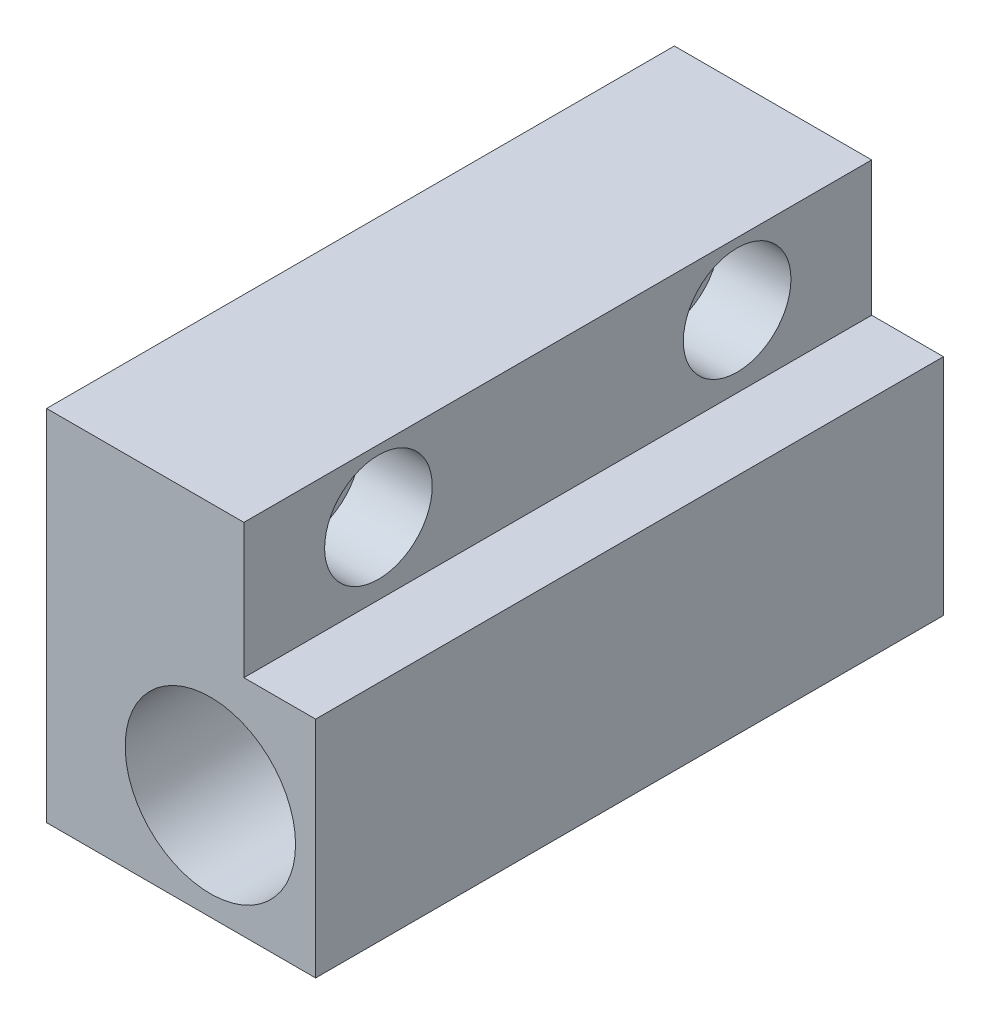
ISO-10303-21;
HEADER;
FILE_DESCRIPTION(('STEP AP214'),'2;1');
FILE_NAME('part.step','',(''),(''),'','','');
FILE_SCHEMA(('AUTOMOTIVE_DESIGN { 1 0 10303 214 1 1 1 1 }'));
ENDSEC;
DATA;
#1=APPLICATION_CONTEXT('core data for automotive mechanical design processes');
#2=APPLICATION_PROTOCOL_DEFINITION('international standard','automotive_design',2000,#1);
#3=PRODUCT_CONTEXT('',#1,'mechanical');
#4=PRODUCT('Part','Part','',(#3));
#5=PRODUCT_RELATED_PRODUCT_CATEGORY('part','',(#4));
#6=PRODUCT_DEFINITION_FORMATION('','',#4);
#7=PRODUCT_DEFINITION_CONTEXT('part definition',#1,'design');
#8=PRODUCT_DEFINITION('design','',#6,#7);
#9=PRODUCT_DEFINITION_SHAPE('','',#8);
#10=(LENGTH_UNIT() NAMED_UNIT(*) SI_UNIT(.MILLI.,.METRE.));
#11=(NAMED_UNIT(*) PLANE_ANGLE_UNIT() SI_UNIT($,.RADIAN.));
#12=(NAMED_UNIT(*) SI_UNIT($,.STERADIAN.) SOLID_ANGLE_UNIT());
#13=UNCERTAINTY_MEASURE_WITH_UNIT(LENGTH_MEASURE(1.E-05),#10,'distance_accuracy_value','');
#14=(GEOMETRIC_REPRESENTATION_CONTEXT(3) GLOBAL_UNCERTAINTY_ASSIGNED_CONTEXT((#13)) GLOBAL_UNIT_ASSIGNED_CONTEXT((#10,
#11,#12)) REPRESENTATION_CONTEXT('',''));
#15=CARTESIAN_POINT('',(0.,0.,0.));
#16=DIRECTION('',(0.,0.,1.));
#17=DIRECTION('',(1.,0.,0.));
#18=AXIS2_PLACEMENT_3D('',#15,#16,#17);
#19=CARTESIAN_POINT('',(-7.15235714285714,23.8428571428571,15.));
#20=DIRECTION('',(1.,0.,0.));
#21=DIRECTION('',(0.,0.,-1.));
#22=AXIS2_PLACEMENT_3D('',#19,#20,#21);
#23=CYLINDRICAL_SURFACE('',#22,3.);
#24=CARTESIAN_POINT('',(32.8476428571429,23.8428571428571,15.));
#25=DIRECTION('',(1.,0.,0.));
#26=DIRECTION('',(0.,1.,0.));
#27=AXIS2_PLACEMENT_3D('',#24,#25,#26);
#28=CIRCLE('',#27,3.);
#29=CARTESIAN_POINT('',(32.8476428571429,26.8428571428571,15.));
#30=VERTEX_POINT('',#29);
#31=EDGE_CURVE('E129',#30,#30,#28,.T.);
#32=ORIENTED_EDGE('',*,*,#31,.F.);
#33=EDGE_LOOP('',(#32));
#34=FACE_BOUND('',#33,.T.);
#35=CARTESIAN_POINT('',(46.8476428571429,23.8428571428571,15.));
#36=DIRECTION('',(1.,0.,0.));
#37=DIRECTION('',(0.,0.,-1.));
#38=AXIS2_PLACEMENT_3D('',#35,#36,#37);
#39=CIRCLE('',#38,3.);
#40=CARTESIAN_POINT('',(46.8476428571429,23.8428571428571,12.));
#41=VERTEX_POINT('',#40);
#42=EDGE_CURVE('E124',#41,#41,#39,.F.);
#43=ORIENTED_EDGE('',*,*,#42,.F.);
#44=EDGE_LOOP('',(#43));
#45=FACE_BOUND('',#44,.T.);
#46=ADVANCED_FACE('F32',(#34,#45),#23,.F.);
#47=CARTESIAN_POINT('',(-7.15235714285714,23.8428571428571,55.));
#48=DIRECTION('',(1.,0.,0.));
#49=DIRECTION('',(0.,0.,-1.));
#50=AXIS2_PLACEMENT_3D('',#47,#48,#49);
#51=CYLINDRICAL_SURFACE('',#50,3.);
#52=CARTESIAN_POINT('',(32.8476428571429,23.8428571428571,55.));
#53=DIRECTION('',(1.,0.,0.));
#54=DIRECTION('',(0.,1.,0.));
#55=AXIS2_PLACEMENT_3D('',#52,#53,#54);
#56=CIRCLE('',#55,3.);
#57=CARTESIAN_POINT('',(32.8476428571429,26.8428571428571,55.));
#58=VERTEX_POINT('',#57);
#59=EDGE_CURVE('E132',#58,#58,#56,.T.);
#60=ORIENTED_EDGE('',*,*,#59,.F.);
#61=EDGE_LOOP('',(#60));
#62=FACE_BOUND('',#61,.T.);
#63=CARTESIAN_POINT('',(46.8476428571429,23.8428571428571,55.));
#64=DIRECTION('',(1.,0.,0.));
#65=DIRECTION('',(0.,0.,-1.));
#66=AXIS2_PLACEMENT_3D('',#63,#64,#65);
#67=CIRCLE('',#66,3.);
#68=CARTESIAN_POINT('',(46.8476428571429,23.8428571428571,52.));
#69=VERTEX_POINT('',#68);
#70=EDGE_CURVE('E128',#69,#69,#67,.F.);
#71=ORIENTED_EDGE('',*,*,#70,.F.);
#72=EDGE_LOOP('',(#71));
#73=FACE_BOUND('',#72,.T.);
#74=ADVANCED_FACE('F179',(#62,#73),#51,.F.);
#75=CARTESIAN_POINT('',(32.8476428571429,30.8428571428571,70.));
#76=DIRECTION('',(1.,0.,0.));
#77=DIRECTION('',(0.,1.,0.));
#78=AXIS2_PLACEMENT_3D('',#75,#76,#77);
#79=PLANE('',#78);
#80=ORIENTED_EDGE('',*,*,#31,.T.);
#81=EDGE_LOOP('',(#80));
#82=FACE_BOUND('',#81,.T.);
#83=ORIENTED_EDGE('',*,*,#59,.T.);
#84=EDGE_LOOP('',(#83));
#85=FACE_BOUND('',#84,.T.);
#86=DIRECTION('',(0.,-1.,0.));
#87=VECTOR('',#86,1.);
#88=CARTESIAN_POINT('',(32.8476428571429,30.8428571428571,0.));
#89=LINE('',#88,#87);
#90=CARTESIAN_POINT('',(32.8476428571429,30.8428571428571,0.));
#91=VERTEX_POINT('',#90);
#92=CARTESIAN_POINT('',(32.8476428571429,-9.15714285714286,0.));
#93=VERTEX_POINT('',#92);
#94=EDGE_CURVE('E135',#91,#93,#89,.T.);
#95=ORIENTED_EDGE('',*,*,#94,.T.);
#96=DIRECTION('',(0.,0.,-1.));
#97=VECTOR('',#96,1.);
#98=CARTESIAN_POINT('',(32.8476428571429,-9.15714285714286,70.));
#99=LINE('',#98,#97);
#100=CARTESIAN_POINT('',(32.8476428571429,-9.15714285714286,70.));
#101=VERTEX_POINT('',#100);
#102=EDGE_CURVE('E40',#101,#93,#99,.T.);
#103=ORIENTED_EDGE('',*,*,#102,.F.);
#104=DIRECTION('',(0.,-1.,0.));
#105=VECTOR('',#104,1.);
#106=CARTESIAN_POINT('',(32.8476428571429,30.8428571428571,70.));
#107=LINE('',#106,#105);
#108=CARTESIAN_POINT('',(32.8476428571429,30.8428571428571,70.));
#109=VERTEX_POINT('',#108);
#110=EDGE_CURVE('E136',#109,#101,#107,.T.);
#111=ORIENTED_EDGE('',*,*,#110,.F.);
#112=DIRECTION('',(0.,0.,-1.));
#113=VECTOR('',#112,1.);
#114=CARTESIAN_POINT('',(32.8476428571429,30.8428571428571,70.));
#115=LINE('',#114,#113);
#116=EDGE_CURVE('E141',#109,#91,#115,.T.);
#117=ORIENTED_EDGE('',*,*,#116,.T.);
#118=EDGE_LOOP('',(#95,#103,#111,#117));
#119=FACE_BOUND('',#118,.T.);
#120=ADVANCED_FACE('F34',(#82,#85,#119),#79,.F.);
#121=CARTESIAN_POINT('',(32.8476428571429,-9.15714285714286,70.));
#122=DIRECTION('',(0.,1.,0.));
#123=DIRECTION('',(0.,0.,1.));
#124=AXIS2_PLACEMENT_3D('',#121,#122,#123);
#125=PLANE('',#124);
#126=DIRECTION('',(1.,0.,0.));
#127=VECTOR('',#126,1.);
#128=CARTESIAN_POINT('',(32.8476428571429,-9.15714285714286,0.));
#129=LINE('',#128,#127);
#130=CARTESIAN_POINT('',(62.8476428571429,-9.15714285714286,0.));
#131=VERTEX_POINT('',#130);
#132=EDGE_CURVE('E144',#93,#131,#129,.T.);
#133=ORIENTED_EDGE('',*,*,#132,.T.);
#134=DIRECTION('',(0.,0.,-1.));
#135=VECTOR('',#134,1.);
#136=CARTESIAN_POINT('',(62.8476428571429,-9.15714285714286,70.));
#137=LINE('',#136,#135);
#138=CARTESIAN_POINT('',(62.8476428571429,-9.15714285714286,70.));
#139=VERTEX_POINT('',#138);
#140=EDGE_CURVE('E151',#139,#131,#137,.T.);
#141=ORIENTED_EDGE('',*,*,#140,.F.);
#142=DIRECTION('',(1.,0.,0.));
#143=VECTOR('',#142,1.);
#144=CARTESIAN_POINT('',(32.8476428571429,-9.15714285714286,70.));
#145=LINE('',#144,#143);
#146=EDGE_CURVE('E79',#101,#139,#145,.T.);
#147=ORIENTED_EDGE('',*,*,#146,.F.);
#148=ORIENTED_EDGE('',*,*,#102,.T.);
#149=EDGE_LOOP('',(#133,#141,#147,#148));
#150=FACE_BOUND('',#149,.T.);
#151=ADVANCED_FACE('F206',(#150),#125,.F.);
#152=CARTESIAN_POINT('',(62.8476428571429,30.8428571428571,70.));
#153=DIRECTION('',(-1.,0.,0.));
#154=DIRECTION('',(0.,0.,1.));
#155=AXIS2_PLACEMENT_3D('',#152,#153,#154);
#156=PLANE('',#155);
#157=DIRECTION('',(0.,1.,0.));
#158=VECTOR('',#157,1.);
#159=CARTESIAN_POINT('',(62.8476428571429,30.8428571428571,0.));
#160=LINE('',#159,#158);
#161=CARTESIAN_POINT('',(62.8476428571429,15.8428571428571,0.));
#162=VERTEX_POINT('',#161);
#163=EDGE_CURVE('E146',#131,#162,#160,.T.);
#164=ORIENTED_EDGE('',*,*,#163,.T.);
#165=DIRECTION('',(0.,0.,1.));
#166=VECTOR('',#165,1.);
#167=CARTESIAN_POINT('',(62.8476428571429,15.8428571428571,-5.));
#168=LINE('',#167,#166);
#169=CARTESIAN_POINT('',(62.8476428571429,15.8428571428571,70.));
#170=VERTEX_POINT('',#169);
#171=EDGE_CURVE('E47',#162,#170,#168,.T.);
#172=ORIENTED_EDGE('',*,*,#171,.T.);
#173=DIRECTION('',(0.,1.,0.));
#174=VECTOR('',#173,1.);
#175=CARTESIAN_POINT('',(62.8476428571429,30.8428571428571,70.));
#176=LINE('',#175,#174);
#177=EDGE_CURVE('E109',#139,#170,#176,.T.);
#178=ORIENTED_EDGE('',*,*,#177,.F.);
#179=ORIENTED_EDGE('',*,*,#140,.T.);
#180=EDGE_LOOP('',(#164,#172,#178,#179));
#181=FACE_BOUND('',#180,.T.);
#182=ADVANCED_FACE('F204',(#181),#156,.F.);
#183=CARTESIAN_POINT('',(32.8476428571429,30.8428571428571,70.));
#184=DIRECTION('',(0.,-1.,0.));
#185=DIRECTION('',(0.,0.,-1.));
#186=AXIS2_PLACEMENT_3D('',#183,#184,#185);
#187=PLANE('',#186);
#188=DIRECTION('',(-1.,0.,0.));
#189=VECTOR('',#188,1.);
#190=CARTESIAN_POINT('',(32.8476428571429,30.8428571428571,70.));
#191=LINE('',#190,#189);
#192=CARTESIAN_POINT('',(54.8476428571429,30.8428571428571,70.));
#193=VERTEX_POINT('',#192);
#194=EDGE_CURVE('E55',#193,#109,#191,.T.);
#195=ORIENTED_EDGE('',*,*,#194,.F.);
#196=DIRECTION('',(0.,0.,1.));
#197=VECTOR('',#196,1.);
#198=CARTESIAN_POINT('',(54.8476428571429,30.8428571428571,-5.));
#199=LINE('',#198,#197);
#200=CARTESIAN_POINT('',(54.8476428571429,30.8428571428571,0.));
#201=VERTEX_POINT('',#200);
#202=EDGE_CURVE('E103',#201,#193,#199,.T.);
#203=ORIENTED_EDGE('',*,*,#202,.F.);
#204=DIRECTION('',(-1.,0.,0.));
#205=VECTOR('',#204,1.);
#206=CARTESIAN_POINT('',(32.8476428571429,30.8428571428571,0.));
#207=LINE('',#206,#205);
#208=EDGE_CURVE('E73',#201,#91,#207,.T.);
#209=ORIENTED_EDGE('',*,*,#208,.T.);
#210=ORIENTED_EDGE('',*,*,#116,.F.);
#211=EDGE_LOOP('',(#195,#203,#209,#210));
#212=FACE_BOUND('',#211,.T.);
#213=ADVANCED_FACE('F196',(#212),#187,.F.);
#214=CARTESIAN_POINT('',(32.8476428571429,-9.15714285714286,70.));
#215=DIRECTION('',(0.,0.,1.));
#216=DIRECTION('',(1.,0.,0.));
#217=AXIS2_PLACEMENT_3D('',#214,#215,#216);
#218=PLANE('',#217);
#219=CARTESIAN_POINT('',(51.1071963165226,2.60819577179289,70.));
#220=DIRECTION('',(0.,0.,1.));
#221=DIRECTION('',(1.,0.,0.));
#222=AXIS2_PLACEMENT_3D('',#219,#220,#221);
#223=CIRCLE('',#222,9.5);
#224=CARTESIAN_POINT('',(60.6071963165226,2.60819577179289,70.));
#225=VERTEX_POINT('',#224);
#226=EDGE_CURVE('E307',#225,#225,#223,.T.);
#227=ORIENTED_EDGE('',*,*,#226,.F.);
#228=EDGE_LOOP('',(#227));
#229=FACE_BOUND('',#228,.T.);
#230=DIRECTION('',(0.,-1.,0.));
#231=VECTOR('',#230,1.);
#232=CARTESIAN_POINT('',(54.8476428571429,30.8428571428571,70.));
#233=LINE('',#232,#231);
#234=CARTESIAN_POINT('',(54.8476428571429,15.8428571428571,70.));
#235=VERTEX_POINT('',#234);
#236=EDGE_CURVE('E101',#193,#235,#233,.T.);
#237=ORIENTED_EDGE('',*,*,#236,.F.);
#238=ORIENTED_EDGE('',*,*,#194,.T.);
#239=ORIENTED_EDGE('',*,*,#110,.T.);
#240=ORIENTED_EDGE('',*,*,#146,.T.);
#241=ORIENTED_EDGE('',*,*,#177,.T.);
#242=DIRECTION('',(1.,0.,0.));
#243=VECTOR('',#242,1.);
#244=CARTESIAN_POINT('',(54.8476428571429,15.8428571428571,70.));
#245=LINE('',#244,#243);
#246=EDGE_CURVE('E97',#235,#170,#245,.T.);
#247=ORIENTED_EDGE('',*,*,#246,.F.);
#248=EDGE_LOOP('',(#237,#238,#239,#240,#241,#247));
#249=FACE_BOUND('',#248,.T.);
#250=ADVANCED_FACE('F107',(#229,#249),#218,.T.);
#251=CARTESIAN_POINT('',(32.8476428571429,-9.15714285714286,0.));
#252=DIRECTION('',(0.,0.,1.));
#253=DIRECTION('',(1.,0.,0.));
#254=AXIS2_PLACEMENT_3D('',#251,#252,#253);
#255=PLANE('',#254);
#256=CARTESIAN_POINT('',(51.1071963165226,2.60819577179289,0.));
#257=DIRECTION('',(0.,0.,1.));
#258=DIRECTION('',(1.,0.,0.));
#259=AXIS2_PLACEMENT_3D('',#256,#257,#258);
#260=CIRCLE('',#259,5.);
#261=CARTESIAN_POINT('',(56.1071963165226,2.60819577179289,0.));
#262=VERTEX_POINT('',#261);
#263=EDGE_CURVE('E306',#262,#262,#260,.T.);
#264=ORIENTED_EDGE('',*,*,#263,.T.);
#265=EDGE_LOOP('',(#264));
#266=FACE_BOUND('',#265,.T.);
#267=ORIENTED_EDGE('',*,*,#208,.F.);
#268=DIRECTION('',(0.,-1.,0.));
#269=VECTOR('',#268,1.);
#270=CARTESIAN_POINT('',(54.8476428571429,-9.15714285714286,0.));
#271=LINE('',#270,#269);
#272=CARTESIAN_POINT('',(54.8476428571429,15.8428571428571,0.));
#273=VERTEX_POINT('',#272);
#274=EDGE_CURVE('E119',#201,#273,#271,.T.);
#275=ORIENTED_EDGE('',*,*,#274,.T.);
#276=DIRECTION('',(1.,0.,0.));
#277=VECTOR('',#276,1.);
#278=CARTESIAN_POINT('',(32.8476428571429,15.8428571428571,0.));
#279=LINE('',#278,#277);
#280=EDGE_CURVE('E11',#273,#162,#279,.T.);
#281=ORIENTED_EDGE('',*,*,#280,.T.);
#282=ORIENTED_EDGE('',*,*,#163,.F.);
#283=ORIENTED_EDGE('',*,*,#132,.F.);
#284=ORIENTED_EDGE('',*,*,#94,.F.);
#285=EDGE_LOOP('',(#267,#275,#281,#282,#283,#284));
#286=FACE_BOUND('',#285,.T.);
#287=ADVANCED_FACE('F195',(#266,#286),#255,.F.);
#288=CARTESIAN_POINT('',(46.8476428571429,23.8428571428571,55.));
#289=DIRECTION('',(1.,0.,0.));
#290=DIRECTION('',(0.,0.,-1.));
#291=AXIS2_PLACEMENT_3D('',#288,#289,#290);
#292=PLANE('',#291);
#293=CARTESIAN_POINT('',(46.8476428571429,23.8428571428571,55.));
#294=DIRECTION('',(1.,0.,0.));
#295=DIRECTION('',(0.,0.,-1.));
#296=AXIS2_PLACEMENT_3D('',#293,#294,#295);
#297=CIRCLE('',#296,6.);
#298=CARTESIAN_POINT('',(46.8476428571429,23.8428571428571,49.));
#299=VERTEX_POINT('',#298);
#300=EDGE_CURVE('E125',#299,#299,#297,.T.);
#301=ORIENTED_EDGE('',*,*,#300,.T.);
#302=EDGE_LOOP('',(#301));
#303=FACE_BOUND('',#302,.T.);
#304=ORIENTED_EDGE('',*,*,#70,.T.);
#305=EDGE_LOOP('',(#304));
#306=FACE_BOUND('',#305,.T.);
#307=ADVANCED_FACE('F200',(#303,#306),#292,.T.);
#308=CARTESIAN_POINT('',(46.8476428571429,23.8428571428571,55.));
#309=DIRECTION('',(1.,0.,0.));
#310=DIRECTION('',(0.,0.,-1.));
#311=AXIS2_PLACEMENT_3D('',#308,#309,#310);
#312=CYLINDRICAL_SURFACE('',#311,6.);
#313=CARTESIAN_POINT('',(54.8476428571429,23.8428571428571,55.));
#314=DIRECTION('',(-1.,0.,0.));
#315=DIRECTION('',(0.,0.,1.));
#316=AXIS2_PLACEMENT_3D('',#313,#314,#315);
#317=CIRCLE('',#316,6.);
#318=CARTESIAN_POINT('',(54.8476428571429,23.8428571428571,61.));
#319=VERTEX_POINT('',#318);
#320=EDGE_CURVE('E116',#319,#319,#317,.F.);
#321=ORIENTED_EDGE('',*,*,#320,.T.);
#322=EDGE_LOOP('',(#321));
#323=FACE_BOUND('',#322,.T.);
#324=ORIENTED_EDGE('',*,*,#300,.F.);
#325=EDGE_LOOP('',(#324));
#326=FACE_BOUND('',#325,.T.);
#327=ADVANCED_FACE('F190',(#323,#326),#312,.F.);
#328=CARTESIAN_POINT('',(46.8476428571429,23.8428571428571,15.));
#329=DIRECTION('',(1.,0.,0.));
#330=DIRECTION('',(0.,0.,-1.));
#331=AXIS2_PLACEMENT_3D('',#328,#329,#330);
#332=PLANE('',#331);
#333=CARTESIAN_POINT('',(46.8476428571429,23.8428571428571,15.));
#334=DIRECTION('',(1.,0.,0.));
#335=DIRECTION('',(0.,0.,-1.));
#336=AXIS2_PLACEMENT_3D('',#333,#334,#335);
#337=CIRCLE('',#336,6.);
#338=CARTESIAN_POINT('',(46.8476428571429,23.8428571428571,9.));
#339=VERTEX_POINT('',#338);
#340=EDGE_CURVE('E121',#339,#339,#337,.T.);
#341=ORIENTED_EDGE('',*,*,#340,.T.);
#342=EDGE_LOOP('',(#341));
#343=FACE_BOUND('',#342,.T.);
#344=ORIENTED_EDGE('',*,*,#42,.T.);
#345=EDGE_LOOP('',(#344));
#346=FACE_BOUND('',#345,.T.);
#347=ADVANCED_FACE('F231',(#343,#346),#332,.T.);
#348=CARTESIAN_POINT('',(46.8476428571429,23.8428571428571,15.));
#349=DIRECTION('',(1.,0.,0.));
#350=DIRECTION('',(0.,0.,-1.));
#351=AXIS2_PLACEMENT_3D('',#348,#349,#350);
#352=CYLINDRICAL_SURFACE('',#351,6.);
#353=CARTESIAN_POINT('',(54.8476428571429,23.8428571428571,15.));
#354=DIRECTION('',(-1.,0.,0.));
#355=DIRECTION('',(0.,0.,1.));
#356=AXIS2_PLACEMENT_3D('',#353,#354,#355);
#357=CIRCLE('',#356,6.);
#358=CARTESIAN_POINT('',(54.8476428571429,23.8428571428571,21.));
#359=VERTEX_POINT('',#358);
#360=EDGE_CURVE('E114',#359,#359,#357,.F.);
#361=ORIENTED_EDGE('',*,*,#360,.T.);
#362=EDGE_LOOP('',(#361));
#363=FACE_BOUND('',#362,.T.);
#364=ORIENTED_EDGE('',*,*,#340,.F.);
#365=EDGE_LOOP('',(#364));
#366=FACE_BOUND('',#365,.T.);
#367=ADVANCED_FACE('F161',(#363,#366),#352,.F.);
#368=CARTESIAN_POINT('',(54.8476428571429,15.8428571428571,-5.));
#369=DIRECTION('',(0.,-1.,0.));
#370=DIRECTION('',(0.,0.,-1.));
#371=AXIS2_PLACEMENT_3D('',#368,#369,#370);
#372=PLANE('',#371);
#373=DIRECTION('',(0.,0.,1.));
#374=VECTOR('',#373,1.);
#375=CARTESIAN_POINT('',(54.8476428571429,15.8428571428571,-5.));
#376=LINE('',#375,#374);
#377=EDGE_CURVE('E93',#273,#235,#376,.T.);
#378=ORIENTED_EDGE('',*,*,#377,.T.);
#379=ORIENTED_EDGE('',*,*,#246,.T.);
#380=ORIENTED_EDGE('',*,*,#171,.F.);
#381=ORIENTED_EDGE('',*,*,#280,.F.);
#382=EDGE_LOOP('',(#378,#379,#380,#381));
#383=FACE_BOUND('',#382,.T.);
#384=ADVANCED_FACE('F95',(#383),#372,.F.);
#385=CARTESIAN_POINT('',(54.8476428571429,30.8428571428571,-5.));
#386=DIRECTION('',(-1.,0.,0.));
#387=DIRECTION('',(0.,0.,1.));
#388=AXIS2_PLACEMENT_3D('',#385,#386,#387);
#389=PLANE('',#388);
#390=ORIENTED_EDGE('',*,*,#320,.F.);
#391=EDGE_LOOP('',(#390));
#392=FACE_BOUND('',#391,.T.);
#393=ORIENTED_EDGE('',*,*,#360,.F.);
#394=EDGE_LOOP('',(#393));
#395=FACE_BOUND('',#394,.T.);
#396=ORIENTED_EDGE('',*,*,#202,.T.);
#397=ORIENTED_EDGE('',*,*,#236,.T.);
#398=ORIENTED_EDGE('',*,*,#377,.F.);
#399=ORIENTED_EDGE('',*,*,#274,.F.);
#400=EDGE_LOOP('',(#396,#397,#398,#399));
#401=FACE_BOUND('',#400,.T.);
#402=ADVANCED_FACE('F102',(#392,#395,#401),#389,.F.);
#403=CARTESIAN_POINT('',(51.1071963165226,2.60819577179289,10.));
#404=DIRECTION('',(0.,0.,1.));
#405=DIRECTION('',(1.,0.,0.));
#406=AXIS2_PLACEMENT_3D('',#403,#404,#405);
#407=CYLINDRICAL_SURFACE('',#406,9.5);
#408=CARTESIAN_POINT('',(51.1071963165226,2.60819577179289,10.));
#409=DIRECTION('',(0.,0.,1.));
#410=DIRECTION('',(1.,0.,0.));
#411=AXIS2_PLACEMENT_3D('',#408,#409,#410);
#412=CIRCLE('',#411,9.5);
#413=CARTESIAN_POINT('',(60.6071963165226,2.60819577179289,10.));
#414=VERTEX_POINT('',#413);
#415=EDGE_CURVE('E104',#414,#414,#412,.T.);
#416=ORIENTED_EDGE('',*,*,#415,.F.);
#417=EDGE_LOOP('',(#416));
#418=FACE_BOUND('',#417,.T.);
#419=ORIENTED_EDGE('',*,*,#226,.T.);
#420=EDGE_LOOP('',(#419));
#421=FACE_BOUND('',#420,.T.);
#422=ADVANCED_FACE('F165',(#418,#421),#407,.F.);
#423=CARTESIAN_POINT('',(51.1071963165226,2.60819577179289,10.));
#424=DIRECTION('',(0.,0.,1.));
#425=DIRECTION('',(1.,0.,0.));
#426=AXIS2_PLACEMENT_3D('',#423,#424,#425);
#427=PLANE('',#426);
#428=CARTESIAN_POINT('',(51.1071963165226,2.60819577179289,10.));
#429=DIRECTION('',(0.,0.,1.));
#430=DIRECTION('',(1.,0.,0.));
#431=AXIS2_PLACEMENT_3D('',#428,#429,#430);
#432=CIRCLE('',#431,5.);
#433=CARTESIAN_POINT('',(56.1071963165226,2.60819577179289,10.));
#434=VERTEX_POINT('',#433);
#435=EDGE_CURVE('E303',#434,#434,#432,.T.);
#436=ORIENTED_EDGE('',*,*,#435,.F.);
#437=EDGE_LOOP('',(#436));
#438=FACE_BOUND('',#437,.T.);
#439=ORIENTED_EDGE('',*,*,#415,.T.);
#440=EDGE_LOOP('',(#439));
#441=FACE_BOUND('',#440,.T.);
#442=ADVANCED_FACE('F172',(#438,#441),#427,.T.);
#443=CARTESIAN_POINT('',(51.1071963165226,2.60819577179289,-40.));
#444=DIRECTION('',(0.,0.,1.));
#445=DIRECTION('',(1.,0.,0.));
#446=AXIS2_PLACEMENT_3D('',#443,#444,#445);
#447=CYLINDRICAL_SURFACE('',#446,5.);
#448=ORIENTED_EDGE('',*,*,#435,.T.);
#449=EDGE_LOOP('',(#448));
#450=FACE_BOUND('',#449,.T.);
#451=ORIENTED_EDGE('',*,*,#263,.F.);
#452=EDGE_LOOP('',(#451));
#453=FACE_BOUND('',#452,.T.);
#454=ADVANCED_FACE('F286',(#450,#453),#447,.F.);
#455=CLOSED_SHELL('',(#46,#74,#120,#151,#182,#213,#250,#287,#307,#327,#347,#367,#384,#402,#422,
#442,#454));
#456=MANIFOLD_SOLID_BREP('B2',#455);
#457=ADVANCED_BREP_SHAPE_REPRESENTATION('',(#18,#456),#14);
#458=SHAPE_DEFINITION_REPRESENTATION(#9,#457);
ENDSEC;
END-ISO-10303-21;
